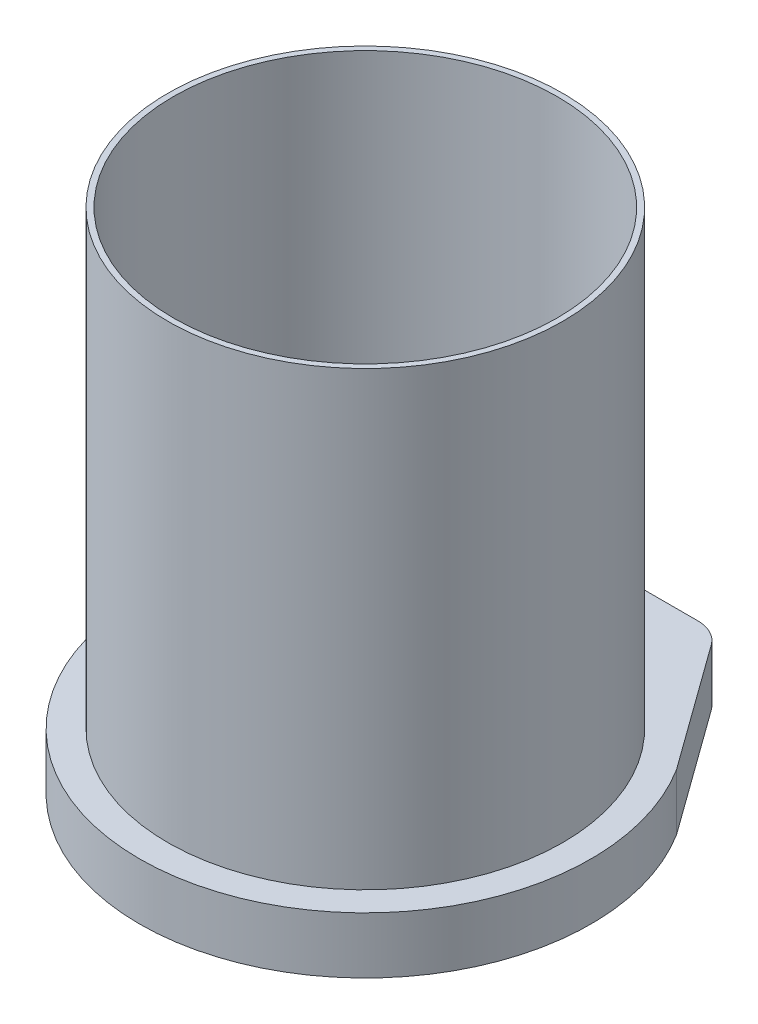
ISO-10303-21;
HEADER;
FILE_DESCRIPTION(('STEP AP214'),'2;1');
FILE_NAME('part.step','',(''),(''),'','','');
FILE_SCHEMA(('AUTOMOTIVE_DESIGN { 1 0 10303 214 1 1 1 1 }'));
ENDSEC;
DATA;
#1=APPLICATION_CONTEXT('core data for automotive mechanical design processes');
#2=APPLICATION_PROTOCOL_DEFINITION('international standard','automotive_design',2000,#1);
#3=PRODUCT_CONTEXT('',#1,'mechanical');
#4=PRODUCT('Part','Part','',(#3));
#5=PRODUCT_RELATED_PRODUCT_CATEGORY('part','',(#4));
#6=PRODUCT_DEFINITION_FORMATION('','',#4);
#7=PRODUCT_DEFINITION_CONTEXT('part definition',#1,'design');
#8=PRODUCT_DEFINITION('design','',#6,#7);
#9=PRODUCT_DEFINITION_SHAPE('','',#8);
#10=(LENGTH_UNIT() NAMED_UNIT(*) SI_UNIT(.MILLI.,.METRE.));
#11=(NAMED_UNIT(*) PLANE_ANGLE_UNIT() SI_UNIT($,.RADIAN.));
#12=(NAMED_UNIT(*) SI_UNIT($,.STERADIAN.) SOLID_ANGLE_UNIT());
#13=UNCERTAINTY_MEASURE_WITH_UNIT(LENGTH_MEASURE(1.E-05),#10,'distance_accuracy_value','');
#14=(GEOMETRIC_REPRESENTATION_CONTEXT(3) GLOBAL_UNCERTAINTY_ASSIGNED_CONTEXT((#13)) GLOBAL_UNIT_ASSIGNED_CONTEXT((#10,
#11,#12)) REPRESENTATION_CONTEXT('',''));
#15=CARTESIAN_POINT('',(0.,0.,0.));
#16=DIRECTION('',(0.,0.,1.));
#17=DIRECTION('',(1.,0.,0.));
#18=AXIS2_PLACEMENT_3D('',#15,#16,#17);
#19=CARTESIAN_POINT('',(0.,400.,0.));
#20=DIRECTION('',(0.,1.,0.));
#21=DIRECTION('',(0.,0.,1.));
#22=AXIS2_PLACEMENT_3D('',#19,#20,#21);
#23=PLANE('',#22);
#24=CARTESIAN_POINT('',(0.,400.,0.));
#25=DIRECTION('',(0.,1.,0.));
#26=DIRECTION('',(1.,0.,0.));
#27=AXIS2_PLACEMENT_3D('',#24,#25,#26);
#28=CIRCLE('',#27,175.);
#29=CARTESIAN_POINT('',(175.,400.,0.));
#30=VERTEX_POINT('',#29);
#31=EDGE_CURVE('E12',#30,#30,#28,.T.);
#32=ORIENTED_EDGE('',*,*,#31,.T.);
#33=EDGE_LOOP('',(#32));
#34=FACE_BOUND('',#33,.T.);
#35=CARTESIAN_POINT('',(0.,400.,0.));
#36=DIRECTION('',(0.,1.,0.));
#37=DIRECTION('',(0.,0.,1.));
#38=AXIS2_PLACEMENT_3D('',#35,#36,#37);
#39=CIRCLE('',#38,170.);
#40=CARTESIAN_POINT('',(0.,400.,170.));
#41=VERTEX_POINT('',#40);
#42=EDGE_CURVE('E50',#41,#41,#39,.T.);
#43=ORIENTED_EDGE('',*,*,#42,.F.);
#44=EDGE_LOOP('',(#43));
#45=FACE_BOUND('',#44,.T.);
#46=ADVANCED_FACE('F40',(#34,#45),#23,.T.);
#47=CARTESIAN_POINT('',(0.,400.,0.));
#48=DIRECTION('',(0.,-1.,0.));
#49=DIRECTION('',(0.,0.,-1.));
#50=AXIS2_PLACEMENT_3D('',#47,#48,#49);
#51=CYLINDRICAL_SURFACE('',#50,175.);
#52=ORIENTED_EDGE('',*,*,#31,.F.);
#53=EDGE_LOOP('',(#52));
#54=FACE_BOUND('',#53,.T.);
#55=CARTESIAN_POINT('',(0.,0.,0.));
#56=DIRECTION('',(0.,1.,0.));
#57=DIRECTION('',(1.,0.,0.));
#58=AXIS2_PLACEMENT_3D('',#55,#56,#57);
#59=CIRCLE('',#58,175.);
#60=CARTESIAN_POINT('',(175.,0.,0.));
#61=VERTEX_POINT('',#60);
#62=EDGE_CURVE('E44',#61,#61,#59,.T.);
#63=ORIENTED_EDGE('',*,*,#62,.T.);
#64=EDGE_LOOP('',(#63));
#65=FACE_BOUND('',#64,.T.);
#66=ADVANCED_FACE('F42',(#54,#65),#51,.T.);
#67=CARTESIAN_POINT('',(0.,400.,0.));
#68=DIRECTION('',(0.,-1.,0.));
#69=DIRECTION('',(0.,0.,-1.));
#70=AXIS2_PLACEMENT_3D('',#67,#68,#69);
#71=CYLINDRICAL_SURFACE('',#70,170.);
#72=ORIENTED_EDGE('',*,*,#42,.T.);
#73=EDGE_LOOP('',(#72));
#74=FACE_BOUND('',#73,.T.);
#75=CARTESIAN_POINT('',(0.,0.,0.));
#76=DIRECTION('',(0.,1.,0.));
#77=DIRECTION('',(0.,0.,1.));
#78=AXIS2_PLACEMENT_3D('',#75,#76,#77);
#79=CIRCLE('',#78,170.);
#80=CARTESIAN_POINT('',(0.,0.,170.));
#81=VERTEX_POINT('',#80);
#82=EDGE_CURVE('E148',#81,#81,#79,.T.);
#83=ORIENTED_EDGE('',*,*,#82,.F.);
#84=EDGE_LOOP('',(#83));
#85=FACE_BOUND('',#84,.T.);
#86=ADVANCED_FACE('F181',(#74,#85),#71,.F.);
#87=CARTESIAN_POINT('',(0.,0.,0.));
#88=DIRECTION('',(0.,1.,0.));
#89=DIRECTION('',(0.,0.,1.));
#90=AXIS2_PLACEMENT_3D('',#87,#88,#89);
#91=PLANE('',#90);
#92=ORIENTED_EDGE('',*,*,#82,.T.);
#93=EDGE_LOOP('',(#92));
#94=FACE_BOUND('',#93,.T.);
#95=ADVANCED_FACE('F160',(#94),#91,.T.);
#96=CARTESIAN_POINT('',(0.,-50.,0.));
#97=DIRECTION('',(0.,1.,0.));
#98=DIRECTION('',(0.,0.,1.));
#99=AXIS2_PLACEMENT_3D('',#96,#97,#98);
#100=CYLINDRICAL_SURFACE('',#99,200.);
#101=CARTESIAN_POINT('',(0.,0.,0.));
#102=DIRECTION('',(0.,-1.,0.));
#103=DIRECTION('',(0.,0.,1.));
#104=AXIS2_PLACEMENT_3D('',#101,#102,#103);
#105=CIRCLE('',#104,200.);
#106=CARTESIAN_POINT('',(169.4250135787,0.,-106.278712703237));
#107=VERTEX_POINT('',#106);
#108=CARTESIAN_POINT('',(-168.982813438289,0.,-106.980412985184));
#109=VERTEX_POINT('',#108);
#110=EDGE_CURVE('E127',#107,#109,#105,.T.);
#111=ORIENTED_EDGE('',*,*,#110,.T.);
#112=DIRECTION('',(0.,1.,0.));
#113=VECTOR('',#112,1.);
#114=CARTESIAN_POINT('',(-168.982813438289,-50.,-106.980412985184));
#115=LINE('',#114,#113);
#116=CARTESIAN_POINT('',(-168.982813438289,-50.,-106.980412985184));
#117=VERTEX_POINT('',#116);
#118=EDGE_CURVE('E144',#117,#109,#115,.T.);
#119=ORIENTED_EDGE('',*,*,#118,.F.);
#120=CARTESIAN_POINT('',(0.,-50.,0.));
#121=DIRECTION('',(0.,-1.,0.));
#122=DIRECTION('',(0.,0.,1.));
#123=AXIS2_PLACEMENT_3D('',#120,#121,#122);
#124=CIRCLE('',#123,200.);
#125=CARTESIAN_POINT('',(169.4250135787,-50.,-106.278712703237));
#126=VERTEX_POINT('',#125);
#127=EDGE_CURVE('E137',#126,#117,#124,.T.);
#128=ORIENTED_EDGE('',*,*,#127,.F.);
#129=DIRECTION('',(0.,1.,0.));
#130=VECTOR('',#129,1.);
#131=CARTESIAN_POINT('',(169.4250135787,-50.,-106.278712703237));
#132=LINE('',#131,#130);
#133=EDGE_CURVE('E123',#126,#107,#132,.T.);
#134=ORIENTED_EDGE('',*,*,#133,.T.);
#135=EDGE_LOOP('',(#111,#119,#128,#134));
#136=FACE_BOUND('',#135,.T.);
#137=ADVANCED_FACE('F165',(#136),#100,.T.);
#138=CARTESIAN_POINT('',(-168.982813438289,-50.,-106.980412985184));
#139=DIRECTION('',(0.810255935689087,0.,0.58607620552331));
#140=DIRECTION('',(0.58607620552331,0.,-0.810255935689087));
#141=AXIS2_PLACEMENT_3D('',#138,#139,#140);
#142=PLANE('',#141);
#143=DIRECTION('',(0.58607620552331,0.,-0.810255935689087));
#144=VECTOR('',#143,1.);
#145=CARTESIAN_POINT('',(-168.982813438289,0.,-106.980412985184));
#146=LINE('',#145,#144);
#147=CARTESIAN_POINT('',(-88.982009615384,0.,-217.582286165699));
#148=VERTEX_POINT('',#147);
#149=EDGE_CURVE('E130',#109,#148,#146,.T.);
#150=ORIENTED_EDGE('',*,*,#149,.T.);
#151=DIRECTION('',(0.,1.,0.));
#152=VECTOR('',#151,1.);
#153=CARTESIAN_POINT('',(-88.982009615384,-50.,-217.582286165699));
#154=LINE('',#153,#152);
#155=CARTESIAN_POINT('',(-88.982009615384,-50.,-217.582286165699));
#156=VERTEX_POINT('',#155);
#157=EDGE_CURVE('E141',#156,#148,#154,.T.);
#158=ORIENTED_EDGE('',*,*,#157,.F.);
#159=DIRECTION('',(0.58607620552331,0.,-0.810255935689087));
#160=VECTOR('',#159,1.);
#161=CARTESIAN_POINT('',(-168.982813438289,-50.,-106.980412985184));
#162=LINE('',#161,#160);
#163=EDGE_CURVE('E96',#117,#156,#162,.T.);
#164=ORIENTED_EDGE('',*,*,#163,.F.);
#165=ORIENTED_EDGE('',*,*,#118,.T.);
#166=EDGE_LOOP('',(#150,#158,#164,#165));
#167=FACE_BOUND('',#166,.T.);
#168=ADVANCED_FACE('F190',(#167),#142,.F.);
#169=CARTESIAN_POINT('',(-64.6743315447113,-50.,-200.));
#170=DIRECTION('',(0.,1.,0.));
#171=DIRECTION('',(0.,0.,1.));
#172=AXIS2_PLACEMENT_3D('',#169,#170,#171);
#173=CYLINDRICAL_SURFACE('',#172,30.);
#174=CARTESIAN_POINT('',(-64.6743315447113,0.,-200.));
#175=DIRECTION('',(0.,-1.,0.));
#176=DIRECTION('',(0.,0.,1.));
#177=AXIS2_PLACEMENT_3D('',#174,#175,#176);
#178=CIRCLE('',#177,30.);
#179=CARTESIAN_POINT('',(-64.6743315447112,0.,-230.));
#180=VERTEX_POINT('',#179);
#181=EDGE_CURVE('E132',#148,#180,#178,.T.);
#182=ORIENTED_EDGE('',*,*,#181,.T.);
#183=DIRECTION('',(0.,1.,0.));
#184=VECTOR('',#183,1.);
#185=CARTESIAN_POINT('',(-64.6743315447112,-50.,-230.));
#186=LINE('',#185,#184);
#187=CARTESIAN_POINT('',(-64.6743315447112,-50.,-230.));
#188=VERTEX_POINT('',#187);
#189=EDGE_CURVE('E118',#188,#180,#186,.T.);
#190=ORIENTED_EDGE('',*,*,#189,.F.);
#191=CARTESIAN_POINT('',(-64.6743315447113,-50.,-200.));
#192=DIRECTION('',(0.,-1.,0.));
#193=DIRECTION('',(0.,0.,1.));
#194=AXIS2_PLACEMENT_3D('',#191,#192,#193);
#195=CIRCLE('',#194,30.);
#196=EDGE_CURVE('E109',#156,#188,#195,.T.);
#197=ORIENTED_EDGE('',*,*,#196,.F.);
#198=ORIENTED_EDGE('',*,*,#157,.T.);
#199=EDGE_LOOP('',(#182,#190,#197,#198));
#200=FACE_BOUND('',#199,.T.);
#201=ADVANCED_FACE('F193',(#200),#173,.T.);
#202=CARTESIAN_POINT('',(-64.6743315447112,-50.,-230.));
#203=DIRECTION('',(0.,0.,1.));
#204=DIRECTION('',(1.,0.,0.));
#205=AXIS2_PLACEMENT_3D('',#202,#203,#204);
#206=PLANE('',#205);
#207=DIRECTION('',(1.,0.,0.));
#208=VECTOR('',#207,1.);
#209=CARTESIAN_POINT('',(-64.6743315447112,0.,-230.));
#210=LINE('',#209,#208);
#211=CARTESIAN_POINT('',(64.6677697036883,0.,-230.));
#212=VERTEX_POINT('',#211);
#213=EDGE_CURVE('E117',#180,#212,#210,.T.);
#214=ORIENTED_EDGE('',*,*,#213,.T.);
#215=DIRECTION('',(0.,1.,0.));
#216=VECTOR('',#215,1.);
#217=CARTESIAN_POINT('',(64.6677697036883,-50.,-230.));
#218=LINE('',#217,#216);
#219=CARTESIAN_POINT('',(64.6677697036883,-50.,-230.));
#220=VERTEX_POINT('',#219);
#221=EDGE_CURVE('E114',#220,#212,#218,.T.);
#222=ORIENTED_EDGE('',*,*,#221,.F.);
#223=DIRECTION('',(1.,0.,0.));
#224=VECTOR('',#223,1.);
#225=CARTESIAN_POINT('',(-64.6743315447112,-50.,-230.));
#226=LINE('',#225,#224);
#227=EDGE_CURVE('E103',#188,#220,#226,.T.);
#228=ORIENTED_EDGE('',*,*,#227,.F.);
#229=ORIENTED_EDGE('',*,*,#189,.T.);
#230=EDGE_LOOP('',(#214,#222,#228,#229));
#231=FACE_BOUND('',#230,.T.);
#232=ADVANCED_FACE('F115',(#231),#206,.F.);
#233=CARTESIAN_POINT('',(64.6677697036884,-50.,-200.));
#234=DIRECTION('',(0.,1.,0.));
#235=DIRECTION('',(0.,0.,1.));
#236=AXIS2_PLACEMENT_3D('',#233,#234,#235);
#237=CYLINDRICAL_SURFACE('',#236,30.);
#238=CARTESIAN_POINT('',(64.6677697036884,0.,-200.));
#239=DIRECTION('',(0.,-1.,0.));
#240=DIRECTION('',(0.,0.,-1.));
#241=AXIS2_PLACEMENT_3D('',#238,#239,#240);
#242=CIRCLE('',#241,30.);
#243=CARTESIAN_POINT('',(88.9815454061703,0.,-217.573853051889));
#244=VERTEX_POINT('',#243);
#245=EDGE_CURVE('E81',#212,#244,#242,.T.);
#246=ORIENTED_EDGE('',*,*,#245,.T.);
#247=DIRECTION('',(0.,1.,0.));
#248=VECTOR('',#247,1.);
#249=CARTESIAN_POINT('',(88.9815454061703,-50.,-217.573853051889));
#250=LINE('',#249,#248);
#251=CARTESIAN_POINT('',(88.9815454061703,-50.,-217.573853051889));
#252=VERTEX_POINT('',#251);
#253=EDGE_CURVE('E119',#252,#244,#250,.T.);
#254=ORIENTED_EDGE('',*,*,#253,.F.);
#255=CARTESIAN_POINT('',(64.6677697036884,-50.,-200.));
#256=DIRECTION('',(0.,-1.,0.));
#257=DIRECTION('',(0.,0.,-1.));
#258=AXIS2_PLACEMENT_3D('',#255,#256,#257);
#259=CIRCLE('',#258,30.);
#260=EDGE_CURVE('E107',#220,#252,#259,.T.);
#261=ORIENTED_EDGE('',*,*,#260,.F.);
#262=ORIENTED_EDGE('',*,*,#221,.T.);
#263=EDGE_LOOP('',(#246,#254,#261,#262));
#264=FACE_BOUND('',#263,.T.);
#265=ADVANCED_FACE('F121',(#264),#237,.T.);
#266=CARTESIAN_POINT('',(88.9815454061703,-50.,-217.573853051889));
#267=DIRECTION('',(-0.810459190082727,0.,0.585795101729649));
#268=DIRECTION('',(0.585795101729649,0.,0.810459190082727));
#269=AXIS2_PLACEMENT_3D('',#266,#267,#268);
#270=PLANE('',#269);
#271=DIRECTION('',(0.585795101729649,0.,0.810459190082727));
#272=VECTOR('',#271,1.);
#273=CARTESIAN_POINT('',(88.9815454061703,0.,-217.573853051889));
#274=LINE('',#273,#272);
#275=EDGE_CURVE('E87',#244,#107,#274,.T.);
#276=ORIENTED_EDGE('',*,*,#275,.T.);
#277=ORIENTED_EDGE('',*,*,#133,.F.);
#278=DIRECTION('',(0.585795101729649,0.,0.810459190082727));
#279=VECTOR('',#278,1.);
#280=CARTESIAN_POINT('',(88.9815454061703,-50.,-217.573853051889));
#281=LINE('',#280,#279);
#282=EDGE_CURVE('E58',#252,#126,#281,.T.);
#283=ORIENTED_EDGE('',*,*,#282,.F.);
#284=ORIENTED_EDGE('',*,*,#253,.T.);
#285=EDGE_LOOP('',(#276,#277,#283,#284));
#286=FACE_BOUND('',#285,.T.);
#287=ADVANCED_FACE('F167',(#286),#270,.F.);
#288=CARTESIAN_POINT('',(0.,-50.,0.));
#289=DIRECTION('',(0.,1.,0.));
#290=DIRECTION('',(0.,0.,1.));
#291=AXIS2_PLACEMENT_3D('',#288,#289,#290);
#292=PLANE('',#291);
#293=ORIENTED_EDGE('',*,*,#127,.T.);
#294=ORIENTED_EDGE('',*,*,#163,.T.);
#295=ORIENTED_EDGE('',*,*,#196,.T.);
#296=ORIENTED_EDGE('',*,*,#227,.T.);
#297=ORIENTED_EDGE('',*,*,#260,.T.);
#298=ORIENTED_EDGE('',*,*,#282,.T.);
#299=EDGE_LOOP('',(#293,#294,#295,#296,#297,#298));
#300=FACE_BOUND('',#299,.T.);
#301=ADVANCED_FACE('F105',(#300),#292,.F.);
#302=ORIENTED_EDGE('',*,*,#62,.F.);
#303=EDGE_LOOP('',(#302));
#304=FACE_BOUND('',#303,.T.);
#305=ORIENTED_EDGE('',*,*,#110,.F.);
#306=ORIENTED_EDGE('',*,*,#275,.F.);
#307=ORIENTED_EDGE('',*,*,#245,.F.);
#308=ORIENTED_EDGE('',*,*,#213,.F.);
#309=ORIENTED_EDGE('',*,*,#181,.F.);
#310=ORIENTED_EDGE('',*,*,#149,.F.);
#311=EDGE_LOOP('',(#305,#306,#307,#308,#309,#310));
#312=FACE_BOUND('',#311,.T.);
#313=ADVANCED_FACE('F156',(#304,#312),#91,.T.);
#314=CLOSED_SHELL('',(#46,#66,#86,#95,#137,#168,#201,#232,#265,#287,#301,#313));
#315=MANIFOLD_SOLID_BREP('B2',#314);
#316=ADVANCED_BREP_SHAPE_REPRESENTATION('',(#18,#315),#14);
#317=SHAPE_DEFINITION_REPRESENTATION(#9,#316);
ENDSEC;
END-ISO-10303-21;
